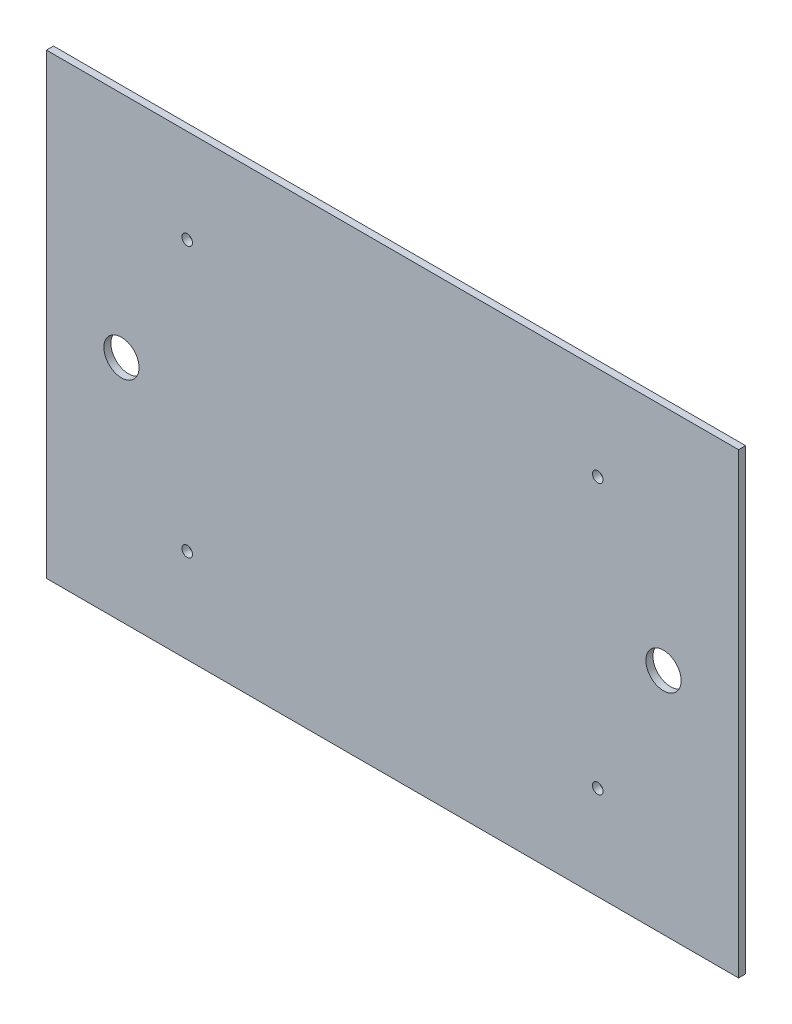
ISO-10303-21;
HEADER;
FILE_DESCRIPTION(('STEP AP214'),'2;1');
FILE_NAME('part.step','',(''),(''),'','','');
FILE_SCHEMA(('AUTOMOTIVE_DESIGN { 1 0 10303 214 1 1 1 1 }'));
ENDSEC;
DATA;
#1=APPLICATION_CONTEXT('core data for automotive mechanical design processes');
#2=APPLICATION_PROTOCOL_DEFINITION('international standard','automotive_design',2000,#1);
#3=PRODUCT_CONTEXT('',#1,'mechanical');
#4=PRODUCT('Part','Part','',(#3));
#5=PRODUCT_RELATED_PRODUCT_CATEGORY('part','',(#4));
#6=PRODUCT_DEFINITION_FORMATION('','',#4);
#7=PRODUCT_DEFINITION_CONTEXT('part definition',#1,'design');
#8=PRODUCT_DEFINITION('design','',#6,#7);
#9=PRODUCT_DEFINITION_SHAPE('','',#8);
#10=(LENGTH_UNIT() NAMED_UNIT(*) SI_UNIT(.MILLI.,.METRE.));
#11=(NAMED_UNIT(*) PLANE_ANGLE_UNIT() SI_UNIT($,.RADIAN.));
#12=(NAMED_UNIT(*) SI_UNIT($,.STERADIAN.) SOLID_ANGLE_UNIT());
#13=UNCERTAINTY_MEASURE_WITH_UNIT(LENGTH_MEASURE(1.E-05),#10,'distance_accuracy_value','');
#14=(GEOMETRIC_REPRESENTATION_CONTEXT(3) GLOBAL_UNCERTAINTY_ASSIGNED_CONTEXT((#13)) GLOBAL_UNIT_ASSIGNED_CONTEXT((#10,
#11,#12)) REPRESENTATION_CONTEXT('',''));
#15=CARTESIAN_POINT('',(0.,0.,0.));
#16=DIRECTION('',(0.,0.,1.));
#17=DIRECTION('',(1.,0.,0.));
#18=AXIS2_PLACEMENT_3D('',#15,#16,#17);
#19=CARTESIAN_POINT('',(0.,-195.,3.));
#20=DIRECTION('',(0.,0.,1.));
#21=DIRECTION('',(1.,0.,0.));
#22=AXIS2_PLACEMENT_3D('',#19,#20,#21);
#23=PLANE('',#22);
#24=CARTESIAN_POINT('',(32.,-97.5,3.));
#25=DIRECTION('',(0.,0.,1.));
#26=DIRECTION('',(1.,0.,0.));
#27=AXIS2_PLACEMENT_3D('',#24,#25,#26);
#28=CIRCLE('',#27,7.5);
#29=CARTESIAN_POINT('',(39.5,-97.5,3.));
#30=VERTEX_POINT('',#29);
#31=EDGE_CURVE('E130',#30,#30,#28,.T.);
#32=ORIENTED_EDGE('',*,*,#31,.F.);
#33=EDGE_LOOP('',(#32));
#34=FACE_BOUND('',#33,.T.);
#35=CARTESIAN_POINT('',(235.,-155.,3.));
#36=DIRECTION('',(0.,0.,1.));
#37=DIRECTION('',(1.,0.,0.));
#38=AXIS2_PLACEMENT_3D('',#35,#36,#37);
#39=CIRCLE('',#38,2.25000000000001);
#40=CARTESIAN_POINT('',(237.25,-155.,3.));
#41=VERTEX_POINT('',#40);
#42=EDGE_CURVE('E118',#41,#41,#39,.T.);
#43=ORIENTED_EDGE('',*,*,#42,.F.);
#44=EDGE_LOOP('',(#43));
#45=FACE_BOUND('',#44,.T.);
#46=CARTESIAN_POINT('',(60.,-40.,3.));
#47=DIRECTION('',(0.,0.,1.));
#48=DIRECTION('',(1.,0.,0.));
#49=AXIS2_PLACEMENT_3D('',#46,#47,#48);
#50=CIRCLE('',#49,2.25);
#51=CARTESIAN_POINT('',(62.25,-40.,3.));
#52=VERTEX_POINT('',#51);
#53=EDGE_CURVE('E97',#52,#52,#50,.T.);
#54=ORIENTED_EDGE('',*,*,#53,.F.);
#55=EDGE_LOOP('',(#54));
#56=FACE_BOUND('',#55,.T.);
#57=DIRECTION('',(0.,-1.,0.));
#58=VECTOR('',#57,1.);
#59=CARTESIAN_POINT('',(0.,0.,3.));
#60=LINE('',#59,#58);
#61=CARTESIAN_POINT('',(0.,0.,3.));
#62=VERTEX_POINT('',#61);
#63=CARTESIAN_POINT('',(0.,-195.,3.));
#64=VERTEX_POINT('',#63);
#65=EDGE_CURVE('E82',#62,#64,#60,.T.);
#66=ORIENTED_EDGE('',*,*,#65,.T.);
#67=DIRECTION('',(1.,0.,0.));
#68=VECTOR('',#67,1.);
#69=CARTESIAN_POINT('',(0.,-195.,3.));
#70=LINE('',#69,#68);
#71=CARTESIAN_POINT('',(295.,-195.,3.));
#72=VERTEX_POINT('',#71);
#73=EDGE_CURVE('E77',#64,#72,#70,.T.);
#74=ORIENTED_EDGE('',*,*,#73,.T.);
#75=DIRECTION('',(0.,1.,0.));
#76=VECTOR('',#75,1.);
#77=CARTESIAN_POINT('',(295.,0.,3.));
#78=LINE('',#77,#76);
#79=CARTESIAN_POINT('',(295.,0.,3.));
#80=VERTEX_POINT('',#79);
#81=EDGE_CURVE('E80',#72,#80,#78,.T.);
#82=ORIENTED_EDGE('',*,*,#81,.T.);
#83=DIRECTION('',(-1.,0.,0.));
#84=VECTOR('',#83,1.);
#85=CARTESIAN_POINT('',(0.,0.,3.));
#86=LINE('',#85,#84);
#87=EDGE_CURVE('E47',#80,#62,#86,.T.);
#88=ORIENTED_EDGE('',*,*,#87,.T.);
#89=EDGE_LOOP('',(#66,#74,#82,#88));
#90=FACE_BOUND('',#89,.T.);
#91=CARTESIAN_POINT('',(235.,-40.,3.));
#92=DIRECTION('',(0.,0.,1.));
#93=DIRECTION('',(-1.,0.,0.));
#94=AXIS2_PLACEMENT_3D('',#91,#92,#93);
#95=CIRCLE('',#94,2.25000000000001);
#96=CARTESIAN_POINT('',(232.75,-40.,3.));
#97=VERTEX_POINT('',#96);
#98=EDGE_CURVE('E112',#97,#97,#95,.T.);
#99=ORIENTED_EDGE('',*,*,#98,.F.);
#100=EDGE_LOOP('',(#99));
#101=FACE_BOUND('',#100,.T.);
#102=CARTESIAN_POINT('',(60.,-155.,3.));
#103=DIRECTION('',(0.,0.,1.));
#104=DIRECTION('',(-1.,0.,0.));
#105=AXIS2_PLACEMENT_3D('',#102,#103,#104);
#106=CIRCLE('',#105,2.25);
#107=CARTESIAN_POINT('',(57.75,-155.,3.));
#108=VERTEX_POINT('',#107);
#109=EDGE_CURVE('E124',#108,#108,#106,.T.);
#110=ORIENTED_EDGE('',*,*,#109,.F.);
#111=EDGE_LOOP('',(#110));
#112=FACE_BOUND('',#111,.T.);
#113=CARTESIAN_POINT('',(263.,-97.5,3.));
#114=DIRECTION('',(0.,0.,1.));
#115=DIRECTION('',(-1.,0.,0.));
#116=AXIS2_PLACEMENT_3D('',#113,#114,#115);
#117=CIRCLE('',#116,7.50000000000007);
#118=CARTESIAN_POINT('',(255.5,-97.5,3.));
#119=VERTEX_POINT('',#118);
#120=EDGE_CURVE('E136',#119,#119,#117,.T.);
#121=ORIENTED_EDGE('',*,*,#120,.F.);
#122=EDGE_LOOP('',(#121));
#123=FACE_BOUND('',#122,.T.);
#124=ADVANCED_FACE('F30',(#34,#45,#56,#90,#101,#112,#123),#23,.T.);
#125=CARTESIAN_POINT('',(0.,-195.,0.));
#126=DIRECTION('',(0.,0.,1.));
#127=DIRECTION('',(1.,0.,0.));
#128=AXIS2_PLACEMENT_3D('',#125,#126,#127);
#129=PLANE('',#128);
#130=CARTESIAN_POINT('',(32.,-97.5,0.));
#131=DIRECTION('',(0.,0.,1.));
#132=DIRECTION('',(1.,0.,0.));
#133=AXIS2_PLACEMENT_3D('',#130,#131,#132);
#134=CIRCLE('',#133,7.5);
#135=CARTESIAN_POINT('',(39.5,-97.5,0.));
#136=VERTEX_POINT('',#135);
#137=EDGE_CURVE('E133',#136,#136,#134,.T.);
#138=ORIENTED_EDGE('',*,*,#137,.T.);
#139=EDGE_LOOP('',(#138));
#140=FACE_BOUND('',#139,.T.);
#141=CARTESIAN_POINT('',(235.,-155.,0.));
#142=DIRECTION('',(0.,0.,1.));
#143=DIRECTION('',(1.,0.,0.));
#144=AXIS2_PLACEMENT_3D('',#141,#142,#143);
#145=CIRCLE('',#144,2.25000000000001);
#146=CARTESIAN_POINT('',(237.25,-155.,0.));
#147=VERTEX_POINT('',#146);
#148=EDGE_CURVE('E121',#147,#147,#145,.T.);
#149=ORIENTED_EDGE('',*,*,#148,.T.);
#150=EDGE_LOOP('',(#149));
#151=FACE_BOUND('',#150,.T.);
#152=CARTESIAN_POINT('',(60.,-40.,0.));
#153=DIRECTION('',(0.,0.,1.));
#154=DIRECTION('',(1.,0.,0.));
#155=AXIS2_PLACEMENT_3D('',#152,#153,#154);
#156=CIRCLE('',#155,2.25);
#157=CARTESIAN_POINT('',(62.25,-40.,0.));
#158=VERTEX_POINT('',#157);
#159=EDGE_CURVE('E109',#158,#158,#156,.T.);
#160=ORIENTED_EDGE('',*,*,#159,.T.);
#161=EDGE_LOOP('',(#160));
#162=FACE_BOUND('',#161,.T.);
#163=DIRECTION('',(0.,-1.,0.));
#164=VECTOR('',#163,1.);
#165=CARTESIAN_POINT('',(0.,0.,0.));
#166=LINE('',#165,#164);
#167=CARTESIAN_POINT('',(0.,0.,0.));
#168=VERTEX_POINT('',#167);
#169=CARTESIAN_POINT('',(0.,-195.,0.));
#170=VERTEX_POINT('',#169);
#171=EDGE_CURVE('E94',#168,#170,#166,.T.);
#172=ORIENTED_EDGE('',*,*,#171,.F.);
#173=DIRECTION('',(-1.,0.,0.));
#174=VECTOR('',#173,1.);
#175=CARTESIAN_POINT('',(0.,0.,0.));
#176=LINE('',#175,#174);
#177=CARTESIAN_POINT('',(295.,0.,0.));
#178=VERTEX_POINT('',#177);
#179=EDGE_CURVE('E70',#178,#168,#176,.T.);
#180=ORIENTED_EDGE('',*,*,#179,.F.);
#181=DIRECTION('',(0.,1.,0.));
#182=VECTOR('',#181,1.);
#183=CARTESIAN_POINT('',(295.,0.,0.));
#184=LINE('',#183,#182);
#185=CARTESIAN_POINT('',(295.,-195.,0.));
#186=VERTEX_POINT('',#185);
#187=EDGE_CURVE('E64',#186,#178,#184,.T.);
#188=ORIENTED_EDGE('',*,*,#187,.F.);
#189=DIRECTION('',(1.,0.,0.));
#190=VECTOR('',#189,1.);
#191=CARTESIAN_POINT('',(0.,-195.,0.));
#192=LINE('',#191,#190);
#193=EDGE_CURVE('E86',#170,#186,#192,.T.);
#194=ORIENTED_EDGE('',*,*,#193,.F.);
#195=EDGE_LOOP('',(#172,#180,#188,#194));
#196=FACE_BOUND('',#195,.T.);
#197=CARTESIAN_POINT('',(235.,-40.,0.));
#198=DIRECTION('',(0.,0.,1.));
#199=DIRECTION('',(-1.,0.,0.));
#200=AXIS2_PLACEMENT_3D('',#197,#198,#199);
#201=CIRCLE('',#200,2.25000000000001);
#202=CARTESIAN_POINT('',(232.75,-40.,0.));
#203=VERTEX_POINT('',#202);
#204=EDGE_CURVE('E115',#203,#203,#201,.T.);
#205=ORIENTED_EDGE('',*,*,#204,.T.);
#206=EDGE_LOOP('',(#205));
#207=FACE_BOUND('',#206,.T.);
#208=CARTESIAN_POINT('',(60.,-155.,0.));
#209=DIRECTION('',(0.,0.,1.));
#210=DIRECTION('',(-1.,0.,0.));
#211=AXIS2_PLACEMENT_3D('',#208,#209,#210);
#212=CIRCLE('',#211,2.25);
#213=CARTESIAN_POINT('',(57.75,-155.,0.));
#214=VERTEX_POINT('',#213);
#215=EDGE_CURVE('E127',#214,#214,#212,.T.);
#216=ORIENTED_EDGE('',*,*,#215,.T.);
#217=EDGE_LOOP('',(#216));
#218=FACE_BOUND('',#217,.T.);
#219=CARTESIAN_POINT('',(263.,-97.5,0.));
#220=DIRECTION('',(0.,0.,1.));
#221=DIRECTION('',(-1.,0.,0.));
#222=AXIS2_PLACEMENT_3D('',#219,#220,#221);
#223=CIRCLE('',#222,7.50000000000007);
#224=CARTESIAN_POINT('',(255.5,-97.5,0.));
#225=VERTEX_POINT('',#224);
#226=EDGE_CURVE('E139',#225,#225,#223,.T.);
#227=ORIENTED_EDGE('',*,*,#226,.T.);
#228=EDGE_LOOP('',(#227));
#229=FACE_BOUND('',#228,.T.);
#230=ADVANCED_FACE('F105',(#140,#151,#162,#196,#207,#218,#229),#129,.F.);
#231=CARTESIAN_POINT('',(0.,0.,3.));
#232=DIRECTION('',(1.,0.,0.));
#233=DIRECTION('',(0.,1.,0.));
#234=AXIS2_PLACEMENT_3D('',#231,#232,#233);
#235=PLANE('',#234);
#236=ORIENTED_EDGE('',*,*,#171,.T.);
#237=DIRECTION('',(0.,0.,-1.));
#238=VECTOR('',#237,1.);
#239=CARTESIAN_POINT('',(0.,-195.,3.));
#240=LINE('',#239,#238);
#241=EDGE_CURVE('E11',#64,#170,#240,.T.);
#242=ORIENTED_EDGE('',*,*,#241,.F.);
#243=ORIENTED_EDGE('',*,*,#65,.F.);
#244=DIRECTION('',(0.,0.,-1.));
#245=VECTOR('',#244,1.);
#246=CARTESIAN_POINT('',(0.,0.,3.));
#247=LINE('',#246,#245);
#248=EDGE_CURVE('E90',#62,#168,#247,.T.);
#249=ORIENTED_EDGE('',*,*,#248,.T.);
#250=EDGE_LOOP('',(#236,#242,#243,#249));
#251=FACE_BOUND('',#250,.T.);
#252=ADVANCED_FACE('F32',(#251),#235,.F.);
#253=CARTESIAN_POINT('',(0.,-195.,3.));
#254=DIRECTION('',(0.,1.,0.));
#255=DIRECTION('',(0.,0.,1.));
#256=AXIS2_PLACEMENT_3D('',#253,#254,#255);
#257=PLANE('',#256);
#258=ORIENTED_EDGE('',*,*,#193,.T.);
#259=DIRECTION('',(0.,0.,-1.));
#260=VECTOR('',#259,1.);
#261=CARTESIAN_POINT('',(295.,-195.,3.));
#262=LINE('',#261,#260);
#263=EDGE_CURVE('E39',#72,#186,#262,.T.);
#264=ORIENTED_EDGE('',*,*,#263,.F.);
#265=ORIENTED_EDGE('',*,*,#73,.F.);
#266=ORIENTED_EDGE('',*,*,#241,.T.);
#267=EDGE_LOOP('',(#258,#264,#265,#266));
#268=FACE_BOUND('',#267,.T.);
#269=ADVANCED_FACE('F85',(#268),#257,.F.);
#270=CARTESIAN_POINT('',(295.,0.,3.));
#271=DIRECTION('',(-1.,0.,0.));
#272=DIRECTION('',(0.,0.,1.));
#273=AXIS2_PLACEMENT_3D('',#270,#271,#272);
#274=PLANE('',#273);
#275=ORIENTED_EDGE('',*,*,#187,.T.);
#276=DIRECTION('',(0.,0.,-1.));
#277=VECTOR('',#276,1.);
#278=CARTESIAN_POINT('',(295.,0.,3.));
#279=LINE('',#278,#277);
#280=EDGE_CURVE('E87',#80,#178,#279,.T.);
#281=ORIENTED_EDGE('',*,*,#280,.F.);
#282=ORIENTED_EDGE('',*,*,#81,.F.);
#283=ORIENTED_EDGE('',*,*,#263,.T.);
#284=EDGE_LOOP('',(#275,#281,#282,#283));
#285=FACE_BOUND('',#284,.T.);
#286=ADVANCED_FACE('F88',(#285),#274,.F.);
#287=CARTESIAN_POINT('',(0.,0.,3.));
#288=DIRECTION('',(0.,-1.,0.));
#289=DIRECTION('',(0.,0.,-1.));
#290=AXIS2_PLACEMENT_3D('',#287,#288,#289);
#291=PLANE('',#290);
#292=ORIENTED_EDGE('',*,*,#179,.T.);
#293=ORIENTED_EDGE('',*,*,#248,.F.);
#294=ORIENTED_EDGE('',*,*,#87,.F.);
#295=ORIENTED_EDGE('',*,*,#280,.T.);
#296=EDGE_LOOP('',(#292,#293,#294,#295));
#297=FACE_BOUND('',#296,.T.);
#298=ADVANCED_FACE('F102',(#297),#291,.F.);
#299=CARTESIAN_POINT('',(60.,-40.,3.));
#300=DIRECTION('',(0.,0.,-1.));
#301=DIRECTION('',(-1.,0.,0.));
#302=AXIS2_PLACEMENT_3D('',#299,#300,#301);
#303=CYLINDRICAL_SURFACE('',#302,2.25);
#304=ORIENTED_EDGE('',*,*,#53,.T.);
#305=EDGE_LOOP('',(#304));
#306=FACE_BOUND('',#305,.T.);
#307=ORIENTED_EDGE('',*,*,#159,.F.);
#308=EDGE_LOOP('',(#307));
#309=FACE_BOUND('',#308,.T.);
#310=ADVANCED_FACE('F159',(#306,#309),#303,.F.);
#311=CARTESIAN_POINT('',(235.,-40.,3.));
#312=DIRECTION('',(0.,0.,-1.));
#313=DIRECTION('',(-1.,0.,0.));
#314=AXIS2_PLACEMENT_3D('',#311,#312,#313);
#315=CYLINDRICAL_SURFACE('',#314,2.25000000000001);
#316=ORIENTED_EDGE('',*,*,#98,.T.);
#317=EDGE_LOOP('',(#316));
#318=FACE_BOUND('',#317,.T.);
#319=ORIENTED_EDGE('',*,*,#204,.F.);
#320=EDGE_LOOP('',(#319));
#321=FACE_BOUND('',#320,.T.);
#322=ADVANCED_FACE('F205',(#318,#321),#315,.F.);
#323=CARTESIAN_POINT('',(235.,-155.,3.));
#324=DIRECTION('',(0.,0.,-1.));
#325=DIRECTION('',(-1.,0.,0.));
#326=AXIS2_PLACEMENT_3D('',#323,#324,#325);
#327=CYLINDRICAL_SURFACE('',#326,2.25000000000001);
#328=ORIENTED_EDGE('',*,*,#42,.T.);
#329=EDGE_LOOP('',(#328));
#330=FACE_BOUND('',#329,.T.);
#331=ORIENTED_EDGE('',*,*,#148,.F.);
#332=EDGE_LOOP('',(#331));
#333=FACE_BOUND('',#332,.T.);
#334=ADVANCED_FACE('F213',(#330,#333),#327,.F.);
#335=CARTESIAN_POINT('',(60.,-155.,3.));
#336=DIRECTION('',(0.,0.,-1.));
#337=DIRECTION('',(-1.,0.,0.));
#338=AXIS2_PLACEMENT_3D('',#335,#336,#337);
#339=CYLINDRICAL_SURFACE('',#338,2.25);
#340=ORIENTED_EDGE('',*,*,#109,.T.);
#341=EDGE_LOOP('',(#340));
#342=FACE_BOUND('',#341,.T.);
#343=ORIENTED_EDGE('',*,*,#215,.F.);
#344=EDGE_LOOP('',(#343));
#345=FACE_BOUND('',#344,.T.);
#346=ADVANCED_FACE('F221',(#342,#345),#339,.F.);
#347=CARTESIAN_POINT('',(32.,-97.5,3.));
#348=DIRECTION('',(0.,0.,-1.));
#349=DIRECTION('',(-1.,0.,0.));
#350=AXIS2_PLACEMENT_3D('',#347,#348,#349);
#351=CYLINDRICAL_SURFACE('',#350,7.5);
#352=ORIENTED_EDGE('',*,*,#31,.T.);
#353=EDGE_LOOP('',(#352));
#354=FACE_BOUND('',#353,.T.);
#355=ORIENTED_EDGE('',*,*,#137,.F.);
#356=EDGE_LOOP('',(#355));
#357=FACE_BOUND('',#356,.T.);
#358=ADVANCED_FACE('F230',(#354,#357),#351,.F.);
#359=CARTESIAN_POINT('',(263.,-97.5,3.));
#360=DIRECTION('',(0.,0.,-1.));
#361=DIRECTION('',(-1.,0.,0.));
#362=AXIS2_PLACEMENT_3D('',#359,#360,#361);
#363=CYLINDRICAL_SURFACE('',#362,7.50000000000007);
#364=ORIENTED_EDGE('',*,*,#120,.T.);
#365=EDGE_LOOP('',(#364));
#366=FACE_BOUND('',#365,.T.);
#367=ORIENTED_EDGE('',*,*,#226,.F.);
#368=EDGE_LOOP('',(#367));
#369=FACE_BOUND('',#368,.T.);
#370=ADVANCED_FACE('F145',(#366,#369),#363,.F.);
#371=CLOSED_SHELL('',(#124,#230,#252,#269,#286,#298,#310,#322,#334,#346,#358,#370));
#372=MANIFOLD_SOLID_BREP('B2',#371);
#373=ADVANCED_BREP_SHAPE_REPRESENTATION('',(#18,#372),#14);
#374=SHAPE_DEFINITION_REPRESENTATION(#9,#373);
ENDSEC;
END-ISO-10303-21;
